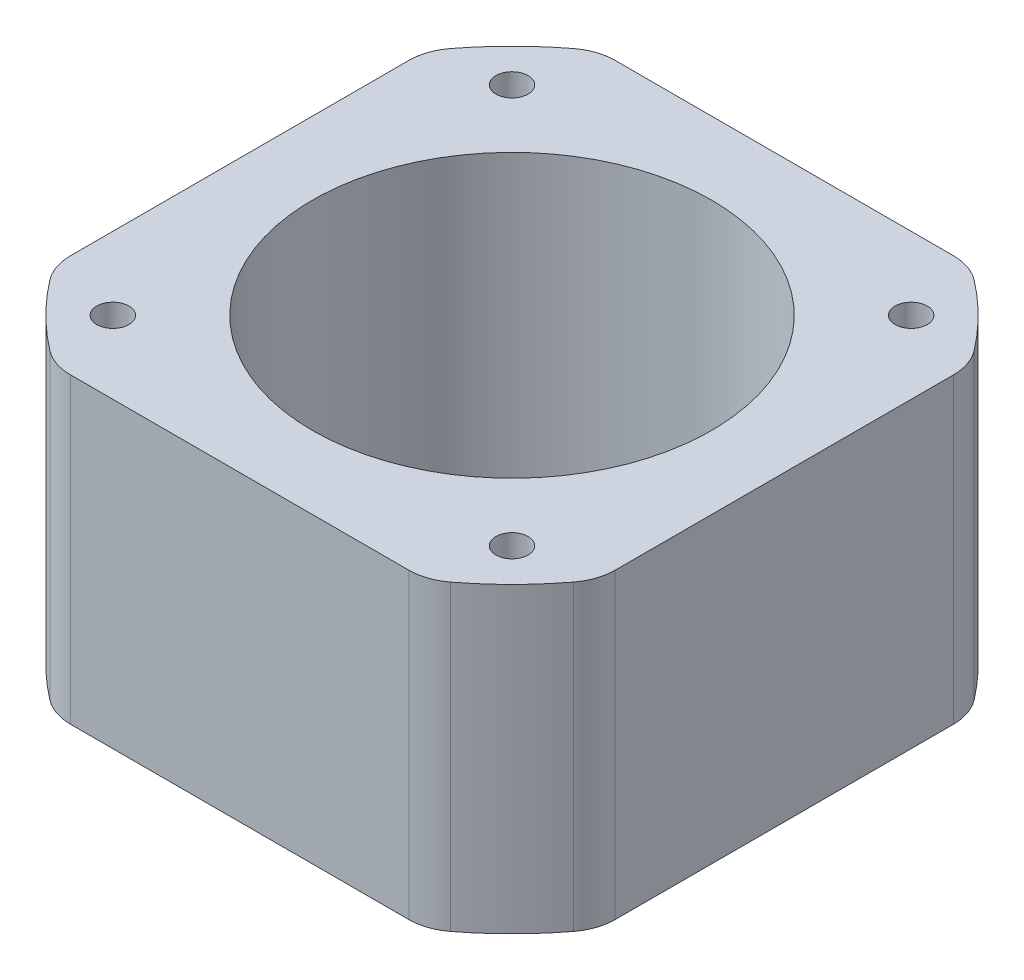
ISO-10303-21;
HEADER;
FILE_DESCRIPTION(('STEP AP214'),'2;1');
FILE_NAME('part.step','',(''),(''),'','','');
FILE_SCHEMA(('AUTOMOTIVE_DESIGN { 1 0 10303 214 1 1 1 1 }'));
ENDSEC;
DATA;
#1=APPLICATION_CONTEXT('core data for automotive mechanical design processes');
#2=APPLICATION_PROTOCOL_DEFINITION('international standard','automotive_design',2000,#1);
#3=PRODUCT_CONTEXT('',#1,'mechanical');
#4=PRODUCT('Part','Part','',(#3));
#5=PRODUCT_RELATED_PRODUCT_CATEGORY('part','',(#4));
#6=PRODUCT_DEFINITION_FORMATION('','',#4);
#7=PRODUCT_DEFINITION_CONTEXT('part definition',#1,'design');
#8=PRODUCT_DEFINITION('design','',#6,#7);
#9=PRODUCT_DEFINITION_SHAPE('','',#8);
#10=(LENGTH_UNIT() NAMED_UNIT(*) SI_UNIT(.MILLI.,.METRE.));
#11=(NAMED_UNIT(*) PLANE_ANGLE_UNIT() SI_UNIT($,.RADIAN.));
#12=(NAMED_UNIT(*) SI_UNIT($,.STERADIAN.) SOLID_ANGLE_UNIT());
#13=UNCERTAINTY_MEASURE_WITH_UNIT(LENGTH_MEASURE(1.E-05),#10,'distance_accuracy_value','');
#14=(GEOMETRIC_REPRESENTATION_CONTEXT(3) GLOBAL_UNCERTAINTY_ASSIGNED_CONTEXT((#13)) GLOBAL_UNIT_ASSIGNED_CONTEXT((#10,
#11,#12)) REPRESENTATION_CONTEXT('',''));
#15=CARTESIAN_POINT('',(0.,0.,0.));
#16=DIRECTION('',(0.,0.,1.));
#17=DIRECTION('',(1.,0.,0.));
#18=AXIS2_PLACEMENT_3D('',#15,#16,#17);
#19=CARTESIAN_POINT('',(0.,23.5,0.));
#20=DIRECTION('',(0.,1.,0.));
#21=DIRECTION('',(0.,0.,1.));
#22=AXIS2_PLACEMENT_3D('',#19,#20,#21);
#23=PLANE('',#22);
#24=CARTESIAN_POINT('',(15.5,23.5,15.5));
#25=DIRECTION('',(0.,1.,0.));
#26=DIRECTION('',(0.,0.,1.));
#27=AXIS2_PLACEMENT_3D('',#24,#25,#26);
#28=CIRCLE('',#27,1.25000000000001);
#29=CARTESIAN_POINT('',(15.5,23.5,16.75));
#30=VERTEX_POINT('',#29);
#31=EDGE_CURVE('E376',#30,#30,#28,.T.);
#32=ORIENTED_EDGE('',*,*,#31,.F.);
#33=EDGE_LOOP('',(#32));
#34=FACE_BOUND('',#33,.T.);
#35=CARTESIAN_POINT('',(-15.5,23.5,-15.5));
#36=DIRECTION('',(0.,1.,0.));
#37=DIRECTION('',(0.,0.,1.));
#38=AXIS2_PLACEMENT_3D('',#35,#36,#37);
#39=CIRCLE('',#38,1.25000000000001);
#40=CARTESIAN_POINT('',(-15.5,23.5,-14.25));
#41=VERTEX_POINT('',#40);
#42=EDGE_CURVE('E362',#41,#41,#39,.T.);
#43=ORIENTED_EDGE('',*,*,#42,.F.);
#44=EDGE_LOOP('',(#43));
#45=FACE_BOUND('',#44,.T.);
#46=CARTESIAN_POINT('',(0.,23.5,0.));
#47=DIRECTION('',(0.,1.,0.));
#48=DIRECTION('',(0.,0.,1.));
#49=AXIS2_PLACEMENT_3D('',#46,#47,#48);
#50=CIRCLE('',#49,25.6);
#51=CARTESIAN_POINT('',(-15.563313761978,23.5,-20.3259259259259));
#52=VERTEX_POINT('',#51);
#53=CARTESIAN_POINT('',(-20.3259259259259,23.5,-15.563313761978));
#54=VERTEX_POINT('',#53);
#55=EDGE_CURVE('E345',#52,#54,#50,.T.);
#56=ORIENTED_EDGE('',*,*,#55,.T.);
#57=CARTESIAN_POINT('',(-17.15,23.5,-13.1315459866689));
#58=DIRECTION('',(0.,1.,0.));
#59=DIRECTION('',(0.,0.,1.));
#60=AXIS2_PLACEMENT_3D('',#57,#58,#59);
#61=CIRCLE('',#60,4.);
#62=CARTESIAN_POINT('',(-21.15,23.5,-13.1315459866689));
#63=VERTEX_POINT('',#62);
#64=EDGE_CURVE('E255',#54,#63,#61,.T.);
#65=ORIENTED_EDGE('',*,*,#64,.T.);
#66=DIRECTION('',(0.,0.,1.));
#67=VECTOR('',#66,1.);
#68=CARTESIAN_POINT('',(-21.15,23.5,14.4235051218489));
#69=LINE('',#68,#67);
#70=CARTESIAN_POINT('',(-21.15,23.5,13.1315459866689));
#71=VERTEX_POINT('',#70);
#72=EDGE_CURVE('E174',#63,#71,#69,.T.);
#73=ORIENTED_EDGE('',*,*,#72,.T.);
#74=CARTESIAN_POINT('',(-17.15,23.5,13.1315459866689));
#75=DIRECTION('',(0.,1.,0.));
#76=DIRECTION('',(0.,0.,1.));
#77=AXIS2_PLACEMENT_3D('',#74,#75,#76);
#78=CIRCLE('',#77,4.);
#79=CARTESIAN_POINT('',(-20.3259259259259,23.5,15.563313761978));
#80=VERTEX_POINT('',#79);
#81=EDGE_CURVE('E235',#71,#80,#78,.T.);
#82=ORIENTED_EDGE('',*,*,#81,.T.);
#83=CARTESIAN_POINT('',(0.,23.5,0.));
#84=DIRECTION('',(0.,1.,0.));
#85=DIRECTION('',(0.,0.,1.));
#86=AXIS2_PLACEMENT_3D('',#83,#84,#85);
#87=CIRCLE('',#86,25.6);
#88=CARTESIAN_POINT('',(-15.563313761978,23.5,20.3259259259259));
#89=VERTEX_POINT('',#88);
#90=EDGE_CURVE('E298',#80,#89,#87,.T.);
#91=ORIENTED_EDGE('',*,*,#90,.T.);
#92=CARTESIAN_POINT('',(-13.1315459866689,23.5,17.15));
#93=DIRECTION('',(0.,1.,0.));
#94=DIRECTION('',(0.,0.,1.));
#95=AXIS2_PLACEMENT_3D('',#92,#93,#94);
#96=CIRCLE('',#95,4.);
#97=CARTESIAN_POINT('',(-13.1315459866689,23.5,21.15));
#98=VERTEX_POINT('',#97);
#99=EDGE_CURVE('E238',#89,#98,#96,.T.);
#100=ORIENTED_EDGE('',*,*,#99,.T.);
#101=DIRECTION('',(1.,0.,0.));
#102=VECTOR('',#101,1.);
#103=CARTESIAN_POINT('',(-14.4235051218489,23.5,21.15));
#104=LINE('',#103,#102);
#105=CARTESIAN_POINT('',(13.1315459866689,23.5,21.15));
#106=VERTEX_POINT('',#105);
#107=EDGE_CURVE('E311',#98,#106,#104,.T.);
#108=ORIENTED_EDGE('',*,*,#107,.T.);
#109=CARTESIAN_POINT('',(13.1315459866689,23.5,17.15));
#110=DIRECTION('',(0.,1.,0.));
#111=DIRECTION('',(0.,0.,1.));
#112=AXIS2_PLACEMENT_3D('',#109,#110,#111);
#113=CIRCLE('',#112,4.);
#114=CARTESIAN_POINT('',(15.563313761978,23.5,20.3259259259259));
#115=VERTEX_POINT('',#114);
#116=EDGE_CURVE('E241',#106,#115,#113,.T.);
#117=ORIENTED_EDGE('',*,*,#116,.T.);
#118=CARTESIAN_POINT('',(0.,23.5,0.));
#119=DIRECTION('',(0.,1.,0.));
#120=DIRECTION('',(0.,0.,1.));
#121=AXIS2_PLACEMENT_3D('',#118,#119,#120);
#122=CIRCLE('',#121,25.6);
#123=CARTESIAN_POINT('',(20.3259259259259,23.5,15.563313761978));
#124=VERTEX_POINT('',#123);
#125=EDGE_CURVE('E314',#115,#124,#122,.T.);
#126=ORIENTED_EDGE('',*,*,#125,.T.);
#127=CARTESIAN_POINT('',(17.15,23.5,13.1315459866689));
#128=DIRECTION('',(0.,1.,0.));
#129=DIRECTION('',(0.,0.,1.));
#130=AXIS2_PLACEMENT_3D('',#127,#128,#129);
#131=CIRCLE('',#130,4.);
#132=CARTESIAN_POINT('',(21.15,23.5,13.1315459866689));
#133=VERTEX_POINT('',#132);
#134=EDGE_CURVE('E61',#124,#133,#131,.T.);
#135=ORIENTED_EDGE('',*,*,#134,.T.);
#136=DIRECTION('',(0.,0.,-1.));
#137=VECTOR('',#136,1.);
#138=CARTESIAN_POINT('',(21.15,23.5,14.4235051218489));
#139=LINE('',#138,#137);
#140=CARTESIAN_POINT('',(21.15,23.5,-13.1315459866689));
#141=VERTEX_POINT('',#140);
#142=EDGE_CURVE('E209',#133,#141,#139,.T.);
#143=ORIENTED_EDGE('',*,*,#142,.T.);
#144=CARTESIAN_POINT('',(17.15,23.5,-13.1315459866689));
#145=DIRECTION('',(0.,1.,0.));
#146=DIRECTION('',(0.,0.,1.));
#147=AXIS2_PLACEMENT_3D('',#144,#145,#146);
#148=CIRCLE('',#147,4.);
#149=CARTESIAN_POINT('',(20.3259259259259,23.5,-15.563313761978));
#150=VERTEX_POINT('',#149);
#151=EDGE_CURVE('E246',#141,#150,#148,.T.);
#152=ORIENTED_EDGE('',*,*,#151,.T.);
#153=CARTESIAN_POINT('',(0.,23.5,0.));
#154=DIRECTION('',(0.,1.,0.));
#155=DIRECTION('',(0.,0.,1.));
#156=AXIS2_PLACEMENT_3D('',#153,#154,#155);
#157=CIRCLE('',#156,25.6);
#158=CARTESIAN_POINT('',(15.563313761978,23.5,-20.3259259259259));
#159=VERTEX_POINT('',#158);
#160=EDGE_CURVE('E207',#150,#159,#157,.T.);
#161=ORIENTED_EDGE('',*,*,#160,.T.);
#162=CARTESIAN_POINT('',(13.1315459866689,23.5,-17.15));
#163=DIRECTION('',(0.,1.,0.));
#164=DIRECTION('',(0.,0.,1.));
#165=AXIS2_PLACEMENT_3D('',#162,#163,#164);
#166=CIRCLE('',#165,4.);
#167=CARTESIAN_POINT('',(13.1315459866689,23.5,-21.15));
#168=VERTEX_POINT('',#167);
#169=EDGE_CURVE('E249',#159,#168,#166,.T.);
#170=ORIENTED_EDGE('',*,*,#169,.T.);
#171=DIRECTION('',(-1.,0.,0.));
#172=VECTOR('',#171,1.);
#173=CARTESIAN_POINT('',(-14.4235051218489,23.5,-21.15));
#174=LINE('',#173,#172);
#175=CARTESIAN_POINT('',(-13.131545986669,23.5,-21.15));
#176=VERTEX_POINT('',#175);
#177=EDGE_CURVE('E346',#168,#176,#174,.T.);
#178=ORIENTED_EDGE('',*,*,#177,.T.);
#179=CARTESIAN_POINT('',(-13.131545986669,23.5,-17.15));
#180=DIRECTION('',(0.,1.,0.));
#181=DIRECTION('',(0.,0.,1.));
#182=AXIS2_PLACEMENT_3D('',#179,#180,#181);
#183=CIRCLE('',#182,4.);
#184=EDGE_CURVE('E252',#176,#52,#183,.T.);
#185=ORIENTED_EDGE('',*,*,#184,.T.);
#186=EDGE_LOOP('',(#56,#65,#73,#82,#91,#100,#108,#117,#126,#135,#143,#152,#161,#170,#178,#185));
#187=FACE_BOUND('',#186,.T.);
#188=CARTESIAN_POINT('',(0.,23.5,0.));
#189=DIRECTION('',(0.,1.,0.));
#190=DIRECTION('',(0.,0.,1.));
#191=AXIS2_PLACEMENT_3D('',#188,#189,#190);
#192=CIRCLE('',#191,15.5);
#193=CARTESIAN_POINT('',(0.,23.5,15.5));
#194=VERTEX_POINT('',#193);
#195=EDGE_CURVE('E327',#194,#194,#192,.T.);
#196=ORIENTED_EDGE('',*,*,#195,.F.);
#197=EDGE_LOOP('',(#196));
#198=FACE_BOUND('',#197,.T.);
#199=CARTESIAN_POINT('',(15.5,23.5,-15.5));
#200=DIRECTION('',(0.,1.,0.));
#201=DIRECTION('',(0.,0.,1.));
#202=AXIS2_PLACEMENT_3D('',#199,#200,#201);
#203=CIRCLE('',#202,1.25000000000001);
#204=CARTESIAN_POINT('',(15.5,23.5,-14.25));
#205=VERTEX_POINT('',#204);
#206=EDGE_CURVE('E369',#205,#205,#203,.T.);
#207=ORIENTED_EDGE('',*,*,#206,.F.);
#208=EDGE_LOOP('',(#207));
#209=FACE_BOUND('',#208,.T.);
#210=CARTESIAN_POINT('',(-15.5,23.5,15.5));
#211=DIRECTION('',(0.,1.,0.));
#212=DIRECTION('',(0.,0.,1.));
#213=AXIS2_PLACEMENT_3D('',#210,#211,#212);
#214=CIRCLE('',#213,1.25000000000001);
#215=CARTESIAN_POINT('',(-15.5,23.5,16.75));
#216=VERTEX_POINT('',#215);
#217=EDGE_CURVE('E384',#216,#216,#214,.T.);
#218=ORIENTED_EDGE('',*,*,#217,.F.);
#219=EDGE_LOOP('',(#218));
#220=FACE_BOUND('',#219,.T.);
#221=ADVANCED_FACE('F38',(#34,#45,#187,#198,#209,#220),#23,.T.);
#222=CARTESIAN_POINT('',(0.,0.,0.));
#223=DIRECTION('',(0.,1.,0.));
#224=DIRECTION('',(0.,0.,1.));
#225=AXIS2_PLACEMENT_3D('',#222,#223,#224);
#226=PLANE('',#225);
#227=CARTESIAN_POINT('',(15.5,0.,15.5));
#228=DIRECTION('',(0.,1.,0.));
#229=DIRECTION('',(0.,0.,1.));
#230=AXIS2_PLACEMENT_3D('',#227,#228,#229);
#231=CIRCLE('',#230,1.25000000000001);
#232=CARTESIAN_POINT('',(15.5,0.,16.75));
#233=VERTEX_POINT('',#232);
#234=EDGE_CURVE('E380',#233,#233,#231,.T.);
#235=ORIENTED_EDGE('',*,*,#234,.T.);
#236=EDGE_LOOP('',(#235));
#237=FACE_BOUND('',#236,.T.);
#238=CARTESIAN_POINT('',(-15.5,0.,-15.5));
#239=DIRECTION('',(0.,1.,0.));
#240=DIRECTION('',(0.,0.,1.));
#241=AXIS2_PLACEMENT_3D('',#238,#239,#240);
#242=CIRCLE('',#241,1.25000000000001);
#243=CARTESIAN_POINT('',(-15.5,0.,-14.25));
#244=VERTEX_POINT('',#243);
#245=EDGE_CURVE('E365',#244,#244,#242,.T.);
#246=ORIENTED_EDGE('',*,*,#245,.T.);
#247=EDGE_LOOP('',(#246));
#248=FACE_BOUND('',#247,.T.);
#249=DIRECTION('',(0.,0.,1.));
#250=VECTOR('',#249,1.);
#251=CARTESIAN_POINT('',(-21.15,0.,14.4235051218489));
#252=LINE('',#251,#250);
#253=CARTESIAN_POINT('',(-21.15,0.,-13.1315459866689));
#254=VERTEX_POINT('',#253);
#255=CARTESIAN_POINT('',(-21.15,0.,13.1315459866689));
#256=VERTEX_POINT('',#255);
#257=EDGE_CURVE('E171',#254,#256,#252,.T.);
#258=ORIENTED_EDGE('',*,*,#257,.F.);
#259=CARTESIAN_POINT('',(-17.15,0.,-13.1315459866689));
#260=DIRECTION('',(0.,1.,0.));
#261=DIRECTION('',(0.,0.,1.));
#262=AXIS2_PLACEMENT_3D('',#259,#260,#261);
#263=CIRCLE('',#262,4.);
#264=CARTESIAN_POINT('',(-20.3259259259259,0.,-15.563313761978));
#265=VERTEX_POINT('',#264);
#266=EDGE_CURVE('E153',#254,#265,#263,.F.);
#267=ORIENTED_EDGE('',*,*,#266,.T.);
#268=CARTESIAN_POINT('',(0.,0.,0.));
#269=DIRECTION('',(0.,1.,0.));
#270=DIRECTION('',(0.,0.,1.));
#271=AXIS2_PLACEMENT_3D('',#268,#269,#270);
#272=CIRCLE('',#271,25.6);
#273=CARTESIAN_POINT('',(-15.563313761978,0.,-20.3259259259259));
#274=VERTEX_POINT('',#273);
#275=EDGE_CURVE('E184',#274,#265,#272,.T.);
#276=ORIENTED_EDGE('',*,*,#275,.F.);
#277=CARTESIAN_POINT('',(-13.131545986669,0.,-17.15));
#278=DIRECTION('',(0.,1.,0.));
#279=DIRECTION('',(0.,0.,1.));
#280=AXIS2_PLACEMENT_3D('',#277,#278,#279);
#281=CIRCLE('',#280,4.);
#282=CARTESIAN_POINT('',(-13.131545986669,0.,-21.15));
#283=VERTEX_POINT('',#282);
#284=EDGE_CURVE('E165',#274,#283,#281,.F.);
#285=ORIENTED_EDGE('',*,*,#284,.T.);
#286=DIRECTION('',(-1.,0.,0.));
#287=VECTOR('',#286,1.);
#288=CARTESIAN_POINT('',(-14.4235051218489,0.,-21.15));
#289=LINE('',#288,#287);
#290=CARTESIAN_POINT('',(13.1315459866689,0.,-21.15));
#291=VERTEX_POINT('',#290);
#292=EDGE_CURVE('E193',#291,#283,#289,.T.);
#293=ORIENTED_EDGE('',*,*,#292,.F.);
#294=CARTESIAN_POINT('',(13.1315459866689,0.,-17.15));
#295=DIRECTION('',(0.,1.,0.));
#296=DIRECTION('',(0.,0.,1.));
#297=AXIS2_PLACEMENT_3D('',#294,#295,#296);
#298=CIRCLE('',#297,4.);
#299=CARTESIAN_POINT('',(15.563313761978,0.,-20.3259259259259));
#300=VERTEX_POINT('',#299);
#301=EDGE_CURVE('E225',#291,#300,#298,.F.);
#302=ORIENTED_EDGE('',*,*,#301,.T.);
#303=CARTESIAN_POINT('',(0.,0.,0.));
#304=DIRECTION('',(0.,1.,0.));
#305=DIRECTION('',(0.,0.,1.));
#306=AXIS2_PLACEMENT_3D('',#303,#304,#305);
#307=CIRCLE('',#306,25.6);
#308=CARTESIAN_POINT('',(20.3259259259259,0.,-15.563313761978));
#309=VERTEX_POINT('',#308);
#310=EDGE_CURVE('E324',#309,#300,#307,.T.);
#311=ORIENTED_EDGE('',*,*,#310,.F.);
#312=CARTESIAN_POINT('',(17.15,0.,-13.1315459866689));
#313=DIRECTION('',(0.,1.,0.));
#314=DIRECTION('',(0.,0.,1.));
#315=AXIS2_PLACEMENT_3D('',#312,#313,#314);
#316=CIRCLE('',#315,4.);
#317=CARTESIAN_POINT('',(21.15,0.,-13.1315459866689));
#318=VERTEX_POINT('',#317);
#319=EDGE_CURVE('E222',#309,#318,#316,.F.);
#320=ORIENTED_EDGE('',*,*,#319,.T.);
#321=DIRECTION('',(0.,0.,-1.));
#322=VECTOR('',#321,1.);
#323=CARTESIAN_POINT('',(21.15,0.,14.4235051218489));
#324=LINE('',#323,#322);
#325=CARTESIAN_POINT('',(21.15,0.,13.1315459866689));
#326=VERTEX_POINT('',#325);
#327=EDGE_CURVE('E204',#326,#318,#324,.T.);
#328=ORIENTED_EDGE('',*,*,#327,.F.);
#329=CARTESIAN_POINT('',(17.15,0.,13.1315459866689));
#330=DIRECTION('',(0.,1.,0.));
#331=DIRECTION('',(0.,0.,1.));
#332=AXIS2_PLACEMENT_3D('',#329,#330,#331);
#333=CIRCLE('',#332,4.);
#334=CARTESIAN_POINT('',(20.3259259259259,0.,15.563313761978));
#335=VERTEX_POINT('',#334);
#336=EDGE_CURVE('E219',#326,#335,#333,.F.);
#337=ORIENTED_EDGE('',*,*,#336,.T.);
#338=CARTESIAN_POINT('',(0.,0.,0.));
#339=DIRECTION('',(0.,1.,0.));
#340=DIRECTION('',(0.,0.,1.));
#341=AXIS2_PLACEMENT_3D('',#338,#339,#340);
#342=CIRCLE('',#341,25.6);
#343=CARTESIAN_POINT('',(15.563313761978,0.,20.3259259259259));
#344=VERTEX_POINT('',#343);
#345=EDGE_CURVE('E200',#344,#335,#342,.T.);
#346=ORIENTED_EDGE('',*,*,#345,.F.);
#347=CARTESIAN_POINT('',(13.1315459866689,0.,17.15));
#348=DIRECTION('',(0.,1.,0.));
#349=DIRECTION('',(0.,0.,1.));
#350=AXIS2_PLACEMENT_3D('',#347,#348,#349);
#351=CIRCLE('',#350,4.);
#352=CARTESIAN_POINT('',(13.1315459866689,0.,21.15));
#353=VERTEX_POINT('',#352);
#354=EDGE_CURVE('E216',#344,#353,#351,.F.);
#355=ORIENTED_EDGE('',*,*,#354,.T.);
#356=DIRECTION('',(1.,0.,0.));
#357=VECTOR('',#356,1.);
#358=CARTESIAN_POINT('',(-14.4235051218489,0.,21.15));
#359=LINE('',#358,#357);
#360=CARTESIAN_POINT('',(-13.1315459866689,0.,21.15));
#361=VERTEX_POINT('',#360);
#362=EDGE_CURVE('E190',#361,#353,#359,.T.);
#363=ORIENTED_EDGE('',*,*,#362,.F.);
#364=CARTESIAN_POINT('',(-13.1315459866689,0.,17.15));
#365=DIRECTION('',(0.,1.,0.));
#366=DIRECTION('',(0.,0.,1.));
#367=AXIS2_PLACEMENT_3D('',#364,#365,#366);
#368=CIRCLE('',#367,4.);
#369=CARTESIAN_POINT('',(-15.563313761978,0.,20.3259259259259));
#370=VERTEX_POINT('',#369);
#371=EDGE_CURVE('E213',#361,#370,#368,.F.);
#372=ORIENTED_EDGE('',*,*,#371,.T.);
#373=CARTESIAN_POINT('',(0.,0.,0.));
#374=DIRECTION('',(0.,1.,0.));
#375=DIRECTION('',(0.,0.,1.));
#376=AXIS2_PLACEMENT_3D('',#373,#374,#375);
#377=CIRCLE('',#376,25.6);
#378=CARTESIAN_POINT('',(-20.3259259259259,0.,15.563313761978));
#379=VERTEX_POINT('',#378);
#380=EDGE_CURVE('E183',#379,#370,#377,.T.);
#381=ORIENTED_EDGE('',*,*,#380,.F.);
#382=CARTESIAN_POINT('',(-17.15,0.,13.1315459866689));
#383=DIRECTION('',(0.,1.,0.));
#384=DIRECTION('',(0.,0.,1.));
#385=AXIS2_PLACEMENT_3D('',#382,#383,#384);
#386=CIRCLE('',#385,4.);
#387=EDGE_CURVE('E176',#379,#256,#386,.F.);
#388=ORIENTED_EDGE('',*,*,#387,.T.);
#389=EDGE_LOOP('',(#258,#267,#276,#285,#293,#302,#311,#320,#328,#337,#346,#355,#363,#372,#381,#388));
#390=FACE_BOUND('',#389,.T.);
#391=CARTESIAN_POINT('',(0.,0.,0.));
#392=DIRECTION('',(0.,1.,0.));
#393=DIRECTION('',(0.,0.,1.));
#394=AXIS2_PLACEMENT_3D('',#391,#392,#393);
#395=CIRCLE('',#394,15.5);
#396=CARTESIAN_POINT('',(0.,0.,15.5));
#397=VERTEX_POINT('',#396);
#398=EDGE_CURVE('E358',#397,#397,#395,.T.);
#399=ORIENTED_EDGE('',*,*,#398,.T.);
#400=EDGE_LOOP('',(#399));
#401=FACE_BOUND('',#400,.T.);
#402=CARTESIAN_POINT('',(15.5,0.,-15.5));
#403=DIRECTION('',(0.,1.,0.));
#404=DIRECTION('',(0.,0.,1.));
#405=AXIS2_PLACEMENT_3D('',#402,#403,#404);
#406=CIRCLE('',#405,1.25000000000001);
#407=CARTESIAN_POINT('',(15.5,0.,-14.25));
#408=VERTEX_POINT('',#407);
#409=EDGE_CURVE('E372',#408,#408,#406,.T.);
#410=ORIENTED_EDGE('',*,*,#409,.T.);
#411=EDGE_LOOP('',(#410));
#412=FACE_BOUND('',#411,.T.);
#413=CARTESIAN_POINT('',(-15.5,0.,15.5));
#414=DIRECTION('',(0.,1.,0.));
#415=DIRECTION('',(0.,0.,1.));
#416=AXIS2_PLACEMENT_3D('',#413,#414,#415);
#417=CIRCLE('',#416,1.25000000000001);
#418=CARTESIAN_POINT('',(-15.5,0.,16.75));
#419=VERTEX_POINT('',#418);
#420=EDGE_CURVE('E388',#419,#419,#417,.T.);
#421=ORIENTED_EDGE('',*,*,#420,.T.);
#422=EDGE_LOOP('',(#421));
#423=FACE_BOUND('',#422,.T.);
#424=ADVANCED_FACE('F179',(#237,#248,#390,#401,#412,#423),#226,.F.);
#425=CARTESIAN_POINT('',(0.,23.5,0.));
#426=DIRECTION('',(0.,-1.,0.));
#427=DIRECTION('',(0.,0.,-1.));
#428=AXIS2_PLACEMENT_3D('',#425,#426,#427);
#429=CYLINDRICAL_SURFACE('',#428,25.6);
#430=ORIENTED_EDGE('',*,*,#310,.T.);
#431=DIRECTION('',(0.,-1.,0.));
#432=VECTOR('',#431,1.);
#433=CARTESIAN_POINT('',(15.563313761978,23.5,-20.3259259259259));
#434=LINE('',#433,#432);
#435=EDGE_CURVE('E267',#300,#159,#434,.F.);
#436=ORIENTED_EDGE('',*,*,#435,.T.);
#437=ORIENTED_EDGE('',*,*,#160,.F.);
#438=DIRECTION('',(0.,-1.,0.));
#439=VECTOR('',#438,1.);
#440=CARTESIAN_POINT('',(20.3259259259259,23.5,-15.563313761978));
#441=LINE('',#440,#439);
#442=EDGE_CURVE('E264',#150,#309,#441,.T.);
#443=ORIENTED_EDGE('',*,*,#442,.T.);
#444=EDGE_LOOP('',(#430,#436,#437,#443));
#445=FACE_BOUND('',#444,.T.);
#446=ADVANCED_FACE('F405',(#445),#429,.T.);
#447=CARTESIAN_POINT('',(-14.4235051218489,23.5,-21.15));
#448=DIRECTION('',(0.,0.,1.));
#449=DIRECTION('',(1.,0.,0.));
#450=AXIS2_PLACEMENT_3D('',#447,#448,#449);
#451=PLANE('',#450);
#452=ORIENTED_EDGE('',*,*,#292,.T.);
#453=DIRECTION('',(0.,-1.,0.));
#454=VECTOR('',#453,1.);
#455=CARTESIAN_POINT('',(-13.131545986669,23.5,-21.15));
#456=LINE('',#455,#454);
#457=EDGE_CURVE('E261',#283,#176,#456,.F.);
#458=ORIENTED_EDGE('',*,*,#457,.T.);
#459=ORIENTED_EDGE('',*,*,#177,.F.);
#460=DIRECTION('',(0.,-1.,0.));
#461=VECTOR('',#460,1.);
#462=CARTESIAN_POINT('',(13.1315459866689,23.5,-21.15));
#463=LINE('',#462,#461);
#464=EDGE_CURVE('E257',#168,#291,#463,.T.);
#465=ORIENTED_EDGE('',*,*,#464,.T.);
#466=EDGE_LOOP('',(#452,#458,#459,#465));
#467=FACE_BOUND('',#466,.T.);
#468=ADVANCED_FACE('F334',(#467),#451,.F.);
#469=CARTESIAN_POINT('',(0.,23.5,0.));
#470=DIRECTION('',(0.,-1.,0.));
#471=DIRECTION('',(0.,0.,-1.));
#472=AXIS2_PLACEMENT_3D('',#469,#470,#471);
#473=CYLINDRICAL_SURFACE('',#472,25.6);
#474=ORIENTED_EDGE('',*,*,#275,.T.);
#475=DIRECTION('',(0.,-1.,0.));
#476=VECTOR('',#475,1.);
#477=CARTESIAN_POINT('',(-20.3259259259259,23.5,-15.563313761978));
#478=LINE('',#477,#476);
#479=EDGE_CURVE('E158',#265,#54,#478,.F.);
#480=ORIENTED_EDGE('',*,*,#479,.T.);
#481=ORIENTED_EDGE('',*,*,#55,.F.);
#482=DIRECTION('',(0.,-1.,0.));
#483=VECTOR('',#482,1.);
#484=CARTESIAN_POINT('',(-15.563313761978,23.5,-20.3259259259259));
#485=LINE('',#484,#483);
#486=EDGE_CURVE('E164',#52,#274,#485,.T.);
#487=ORIENTED_EDGE('',*,*,#486,.T.);
#488=EDGE_LOOP('',(#474,#480,#481,#487));
#489=FACE_BOUND('',#488,.T.);
#490=ADVANCED_FACE('F348',(#489),#473,.T.);
#491=CARTESIAN_POINT('',(-21.15,23.5,14.4235051218489));
#492=DIRECTION('',(1.,0.,0.));
#493=DIRECTION('',(0.,0.,-1.));
#494=AXIS2_PLACEMENT_3D('',#491,#492,#493);
#495=PLANE('',#494);
#496=ORIENTED_EDGE('',*,*,#72,.F.);
#497=DIRECTION('',(0.,-1.,0.));
#498=VECTOR('',#497,1.);
#499=CARTESIAN_POINT('',(-21.15,23.5,-13.1315459866689));
#500=LINE('',#499,#498);
#501=EDGE_CURVE('E157',#63,#254,#500,.T.);
#502=ORIENTED_EDGE('',*,*,#501,.T.);
#503=ORIENTED_EDGE('',*,*,#257,.T.);
#504=DIRECTION('',(0.,-1.,0.));
#505=VECTOR('',#504,1.);
#506=CARTESIAN_POINT('',(-21.15,23.5,13.1315459866689));
#507=LINE('',#506,#505);
#508=EDGE_CURVE('E177',#256,#71,#507,.F.);
#509=ORIENTED_EDGE('',*,*,#508,.T.);
#510=EDGE_LOOP('',(#496,#502,#503,#509));
#511=FACE_BOUND('',#510,.T.);
#512=ADVANCED_FACE('F170',(#511),#495,.F.);
#513=CARTESIAN_POINT('',(0.,23.5,0.));
#514=DIRECTION('',(0.,-1.,0.));
#515=DIRECTION('',(0.,0.,-1.));
#516=AXIS2_PLACEMENT_3D('',#513,#514,#515);
#517=CYLINDRICAL_SURFACE('',#516,25.6);
#518=ORIENTED_EDGE('',*,*,#380,.T.);
#519=DIRECTION('',(0.,-1.,0.));
#520=VECTOR('',#519,1.);
#521=CARTESIAN_POINT('',(-15.563313761978,23.5,20.3259259259259));
#522=LINE('',#521,#520);
#523=EDGE_CURVE('E11',#370,#89,#522,.F.);
#524=ORIENTED_EDGE('',*,*,#523,.T.);
#525=ORIENTED_EDGE('',*,*,#90,.F.);
#526=DIRECTION('',(0.,-1.,0.));
#527=VECTOR('',#526,1.);
#528=CARTESIAN_POINT('',(-20.3259259259259,23.5,15.563313761978));
#529=LINE('',#528,#527);
#530=EDGE_CURVE('E47',#80,#379,#529,.T.);
#531=ORIENTED_EDGE('',*,*,#530,.T.);
#532=EDGE_LOOP('',(#518,#524,#525,#531));
#533=FACE_BOUND('',#532,.T.);
#534=ADVANCED_FACE('F295',(#533),#517,.T.);
#535=CARTESIAN_POINT('',(-14.4235051218489,23.5,21.15));
#536=DIRECTION('',(0.,0.,-1.));
#537=DIRECTION('',(-1.,0.,0.));
#538=AXIS2_PLACEMENT_3D('',#535,#536,#537);
#539=PLANE('',#538);
#540=ORIENTED_EDGE('',*,*,#362,.T.);
#541=DIRECTION('',(0.,-1.,0.));
#542=VECTOR('',#541,1.);
#543=CARTESIAN_POINT('',(13.1315459866689,23.5,21.15));
#544=LINE('',#543,#542);
#545=EDGE_CURVE('E287',#353,#106,#544,.F.);
#546=ORIENTED_EDGE('',*,*,#545,.T.);
#547=ORIENTED_EDGE('',*,*,#107,.F.);
#548=DIRECTION('',(0.,-1.,0.));
#549=VECTOR('',#548,1.);
#550=CARTESIAN_POINT('',(-13.1315459866689,23.5,21.15));
#551=LINE('',#550,#549);
#552=EDGE_CURVE('E283',#98,#361,#551,.T.);
#553=ORIENTED_EDGE('',*,*,#552,.T.);
#554=EDGE_LOOP('',(#540,#546,#547,#553));
#555=FACE_BOUND('',#554,.T.);
#556=ADVANCED_FACE('F308',(#555),#539,.F.);
#557=CARTESIAN_POINT('',(0.,23.5,0.));
#558=DIRECTION('',(0.,-1.,0.));
#559=DIRECTION('',(0.,0.,-1.));
#560=AXIS2_PLACEMENT_3D('',#557,#558,#559);
#561=CYLINDRICAL_SURFACE('',#560,25.6);
#562=ORIENTED_EDGE('',*,*,#345,.T.);
#563=DIRECTION('',(0.,-1.,0.));
#564=VECTOR('',#563,1.);
#565=CARTESIAN_POINT('',(20.3259259259259,23.5,15.563313761978));
#566=LINE('',#565,#564);
#567=EDGE_CURVE('E280',#335,#124,#566,.F.);
#568=ORIENTED_EDGE('',*,*,#567,.T.);
#569=ORIENTED_EDGE('',*,*,#125,.F.);
#570=DIRECTION('',(0.,-1.,0.));
#571=VECTOR('',#570,1.);
#572=CARTESIAN_POINT('',(15.563313761978,23.5,20.3259259259259));
#573=LINE('',#572,#571);
#574=EDGE_CURVE('E276',#115,#344,#573,.T.);
#575=ORIENTED_EDGE('',*,*,#574,.T.);
#576=EDGE_LOOP('',(#562,#568,#569,#575));
#577=FACE_BOUND('',#576,.T.);
#578=ADVANCED_FACE('F417',(#577),#561,.T.);
#579=CARTESIAN_POINT('',(21.15,23.5,14.4235051218489));
#580=DIRECTION('',(-1.,0.,0.));
#581=DIRECTION('',(0.,0.,1.));
#582=AXIS2_PLACEMENT_3D('',#579,#580,#581);
#583=PLANE('',#582);
#584=ORIENTED_EDGE('',*,*,#327,.T.);
#585=DIRECTION('',(0.,-1.,0.));
#586=VECTOR('',#585,1.);
#587=CARTESIAN_POINT('',(21.15,23.5,-13.1315459866689));
#588=LINE('',#587,#586);
#589=EDGE_CURVE('E54',#318,#141,#588,.F.);
#590=ORIENTED_EDGE('',*,*,#589,.T.);
#591=ORIENTED_EDGE('',*,*,#142,.F.);
#592=DIRECTION('',(0.,-1.,0.));
#593=VECTOR('',#592,1.);
#594=CARTESIAN_POINT('',(21.15,23.5,13.1315459866689));
#595=LINE('',#594,#593);
#596=EDGE_CURVE('E270',#133,#326,#595,.T.);
#597=ORIENTED_EDGE('',*,*,#596,.T.);
#598=EDGE_LOOP('',(#584,#590,#591,#597));
#599=FACE_BOUND('',#598,.T.);
#600=ADVANCED_FACE('F414',(#599),#583,.F.);
#601=CARTESIAN_POINT('',(0.,23.5,0.));
#602=DIRECTION('',(0.,-1.,0.));
#603=DIRECTION('',(0.,0.,-1.));
#604=AXIS2_PLACEMENT_3D('',#601,#602,#603);
#605=CYLINDRICAL_SURFACE('',#604,15.5);
#606=ORIENTED_EDGE('',*,*,#195,.T.);
#607=EDGE_LOOP('',(#606));
#608=FACE_BOUND('',#607,.T.);
#609=ORIENTED_EDGE('',*,*,#398,.F.);
#610=EDGE_LOOP('',(#609));
#611=FACE_BOUND('',#610,.T.);
#612=ADVANCED_FACE('F411',(#608,#611),#605,.F.);
#613=CARTESIAN_POINT('',(-15.5,23.5,-15.5));
#614=DIRECTION('',(0.,-1.,0.));
#615=DIRECTION('',(0.,0.,-1.));
#616=AXIS2_PLACEMENT_3D('',#613,#614,#615);
#617=CYLINDRICAL_SURFACE('',#616,1.25000000000001);
#618=ORIENTED_EDGE('',*,*,#42,.T.);
#619=EDGE_LOOP('',(#618));
#620=FACE_BOUND('',#619,.T.);
#621=ORIENTED_EDGE('',*,*,#245,.F.);
#622=EDGE_LOOP('',(#621));
#623=FACE_BOUND('',#622,.T.);
#624=ADVANCED_FACE('F518',(#620,#623),#617,.F.);
#625=CARTESIAN_POINT('',(15.5,23.5,-15.5));
#626=DIRECTION('',(0.,-1.,0.));
#627=DIRECTION('',(0.,0.,-1.));
#628=AXIS2_PLACEMENT_3D('',#625,#626,#627);
#629=CYLINDRICAL_SURFACE('',#628,1.25000000000001);
#630=ORIENTED_EDGE('',*,*,#206,.T.);
#631=EDGE_LOOP('',(#630));
#632=FACE_BOUND('',#631,.T.);
#633=ORIENTED_EDGE('',*,*,#409,.F.);
#634=EDGE_LOOP('',(#633));
#635=FACE_BOUND('',#634,.T.);
#636=ADVANCED_FACE('F509',(#632,#635),#629,.F.);
#637=CARTESIAN_POINT('',(15.5,23.5,15.5));
#638=DIRECTION('',(0.,-1.,0.));
#639=DIRECTION('',(0.,0.,-1.));
#640=AXIS2_PLACEMENT_3D('',#637,#638,#639);
#641=CYLINDRICAL_SURFACE('',#640,1.25000000000001);
#642=ORIENTED_EDGE('',*,*,#31,.T.);
#643=EDGE_LOOP('',(#642));
#644=FACE_BOUND('',#643,.T.);
#645=ORIENTED_EDGE('',*,*,#234,.F.);
#646=EDGE_LOOP('',(#645));
#647=FACE_BOUND('',#646,.T.);
#648=ADVANCED_FACE('F500',(#644,#647),#641,.F.);
#649=CARTESIAN_POINT('',(-15.5,23.5,15.5));
#650=DIRECTION('',(0.,-1.,0.));
#651=DIRECTION('',(0.,0.,-1.));
#652=AXIS2_PLACEMENT_3D('',#649,#650,#651);
#653=CYLINDRICAL_SURFACE('',#652,1.25000000000001);
#654=ORIENTED_EDGE('',*,*,#217,.T.);
#655=EDGE_LOOP('',(#654));
#656=FACE_BOUND('',#655,.T.);
#657=ORIENTED_EDGE('',*,*,#420,.F.);
#658=EDGE_LOOP('',(#657));
#659=FACE_BOUND('',#658,.T.);
#660=ADVANCED_FACE('F396',(#656,#659),#653,.F.);
#661=CARTESIAN_POINT('',(-17.15,23.5,-13.1315459866689));
#662=DIRECTION('',(0.,-1.,0.));
#663=DIRECTION('',(0.,0.,-1.));
#664=AXIS2_PLACEMENT_3D('',#661,#662,#663);
#665=CYLINDRICAL_SURFACE('',#664,4.);
#666=ORIENTED_EDGE('',*,*,#64,.F.);
#667=ORIENTED_EDGE('',*,*,#479,.F.);
#668=ORIENTED_EDGE('',*,*,#266,.F.);
#669=ORIENTED_EDGE('',*,*,#501,.F.);
#670=EDGE_LOOP('',(#666,#667,#668,#669));
#671=FACE_BOUND('',#670,.T.);
#672=ADVANCED_FACE('F156',(#671),#665,.T.);
#673=CARTESIAN_POINT('',(-13.131545986669,23.5,-17.15));
#674=DIRECTION('',(0.,-1.,0.));
#675=DIRECTION('',(0.,0.,-1.));
#676=AXIS2_PLACEMENT_3D('',#673,#674,#675);
#677=CYLINDRICAL_SURFACE('',#676,4.);
#678=ORIENTED_EDGE('',*,*,#184,.F.);
#679=ORIENTED_EDGE('',*,*,#457,.F.);
#680=ORIENTED_EDGE('',*,*,#284,.F.);
#681=ORIENTED_EDGE('',*,*,#486,.F.);
#682=EDGE_LOOP('',(#678,#679,#680,#681));
#683=FACE_BOUND('',#682,.T.);
#684=ADVANCED_FACE('F340',(#683),#677,.T.);
#685=CARTESIAN_POINT('',(13.1315459866689,23.5,-17.15));
#686=DIRECTION('',(0.,-1.,0.));
#687=DIRECTION('',(0.,0.,-1.));
#688=AXIS2_PLACEMENT_3D('',#685,#686,#687);
#689=CYLINDRICAL_SURFACE('',#688,4.);
#690=ORIENTED_EDGE('',*,*,#169,.F.);
#691=ORIENTED_EDGE('',*,*,#435,.F.);
#692=ORIENTED_EDGE('',*,*,#301,.F.);
#693=ORIENTED_EDGE('',*,*,#464,.F.);
#694=EDGE_LOOP('',(#690,#691,#692,#693));
#695=FACE_BOUND('',#694,.T.);
#696=ADVANCED_FACE('F438',(#695),#689,.T.);
#697=CARTESIAN_POINT('',(17.15,23.5,-13.1315459866689));
#698=DIRECTION('',(0.,-1.,0.));
#699=DIRECTION('',(0.,0.,-1.));
#700=AXIS2_PLACEMENT_3D('',#697,#698,#699);
#701=CYLINDRICAL_SURFACE('',#700,4.);
#702=ORIENTED_EDGE('',*,*,#151,.F.);
#703=ORIENTED_EDGE('',*,*,#589,.F.);
#704=ORIENTED_EDGE('',*,*,#319,.F.);
#705=ORIENTED_EDGE('',*,*,#442,.F.);
#706=EDGE_LOOP('',(#702,#703,#704,#705));
#707=FACE_BOUND('',#706,.T.);
#708=ADVANCED_FACE('F441',(#707),#701,.T.);
#709=CARTESIAN_POINT('',(17.15,23.5,13.1315459866689));
#710=DIRECTION('',(0.,-1.,0.));
#711=DIRECTION('',(0.,0.,-1.));
#712=AXIS2_PLACEMENT_3D('',#709,#710,#711);
#713=CYLINDRICAL_SURFACE('',#712,4.);
#714=ORIENTED_EDGE('',*,*,#134,.F.);
#715=ORIENTED_EDGE('',*,*,#567,.F.);
#716=ORIENTED_EDGE('',*,*,#336,.F.);
#717=ORIENTED_EDGE('',*,*,#596,.F.);
#718=EDGE_LOOP('',(#714,#715,#716,#717));
#719=FACE_BOUND('',#718,.T.);
#720=ADVANCED_FACE('F445',(#719),#713,.T.);
#721=CARTESIAN_POINT('',(13.1315459866689,23.5,17.15));
#722=DIRECTION('',(0.,-1.,0.));
#723=DIRECTION('',(0.,0.,-1.));
#724=AXIS2_PLACEMENT_3D('',#721,#722,#723);
#725=CYLINDRICAL_SURFACE('',#724,4.);
#726=ORIENTED_EDGE('',*,*,#116,.F.);
#727=ORIENTED_EDGE('',*,*,#545,.F.);
#728=ORIENTED_EDGE('',*,*,#354,.F.);
#729=ORIENTED_EDGE('',*,*,#574,.F.);
#730=EDGE_LOOP('',(#726,#727,#728,#729));
#731=FACE_BOUND('',#730,.T.);
#732=ADVANCED_FACE('F449',(#731),#725,.T.);
#733=CARTESIAN_POINT('',(-13.1315459866689,23.5,17.15));
#734=DIRECTION('',(0.,-1.,0.));
#735=DIRECTION('',(0.,0.,-1.));
#736=AXIS2_PLACEMENT_3D('',#733,#734,#735);
#737=CYLINDRICAL_SURFACE('',#736,4.);
#738=ORIENTED_EDGE('',*,*,#99,.F.);
#739=ORIENTED_EDGE('',*,*,#523,.F.);
#740=ORIENTED_EDGE('',*,*,#371,.F.);
#741=ORIENTED_EDGE('',*,*,#552,.F.);
#742=EDGE_LOOP('',(#738,#739,#740,#741));
#743=FACE_BOUND('',#742,.T.);
#744=ADVANCED_FACE('F305',(#743),#737,.T.);
#745=CARTESIAN_POINT('',(-17.15,23.5,13.1315459866689));
#746=DIRECTION('',(0.,-1.,0.));
#747=DIRECTION('',(0.,0.,-1.));
#748=AXIS2_PLACEMENT_3D('',#745,#746,#747);
#749=CYLINDRICAL_SURFACE('',#748,4.);
#750=ORIENTED_EDGE('',*,*,#81,.F.);
#751=ORIENTED_EDGE('',*,*,#508,.F.);
#752=ORIENTED_EDGE('',*,*,#387,.F.);
#753=ORIENTED_EDGE('',*,*,#530,.F.);
#754=EDGE_LOOP('',(#750,#751,#752,#753));
#755=FACE_BOUND('',#754,.T.);
#756=ADVANCED_FACE('F40',(#755),#749,.T.);
#757=CLOSED_SHELL('',(#221,#424,#446,#468,#490,#512,#534,#556,#578,#600,#612,#624,#636,#648,
#660,#672,#684,#696,#708,#720,#732,#744,#756));
#758=MANIFOLD_SOLID_BREP('B2',#757);
#759=ADVANCED_BREP_SHAPE_REPRESENTATION('',(#18,#758),#14);
#760=SHAPE_DEFINITION_REPRESENTATION(#9,#759);
ENDSEC;
END-ISO-10303-21;
